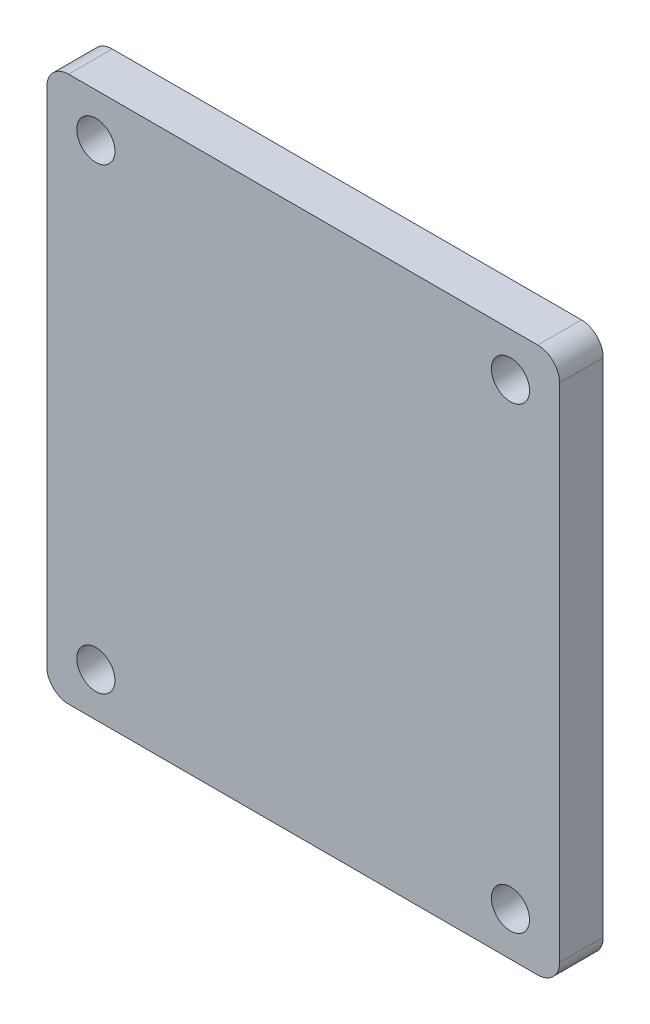
ISO-10303-21;
HEADER;
FILE_DESCRIPTION(('STEP AP214'),'2;1');
FILE_NAME('part.step','',(''),(''),'','','');
FILE_SCHEMA(('AUTOMOTIVE_DESIGN { 1 0 10303 214 1 1 1 1 }'));
ENDSEC;
DATA;
#1=APPLICATION_CONTEXT('core data for automotive mechanical design processes');
#2=APPLICATION_PROTOCOL_DEFINITION('international standard','automotive_design',2000,#1);
#3=PRODUCT_CONTEXT('',#1,'mechanical');
#4=PRODUCT('Part','Part','',(#3));
#5=PRODUCT_RELATED_PRODUCT_CATEGORY('part','',(#4));
#6=PRODUCT_DEFINITION_FORMATION('','',#4);
#7=PRODUCT_DEFINITION_CONTEXT('part definition',#1,'design');
#8=PRODUCT_DEFINITION('design','',#6,#7);
#9=PRODUCT_DEFINITION_SHAPE('','',#8);
#10=(LENGTH_UNIT() NAMED_UNIT(*) SI_UNIT(.MILLI.,.METRE.));
#11=(NAMED_UNIT(*) PLANE_ANGLE_UNIT() SI_UNIT($,.RADIAN.));
#12=(NAMED_UNIT(*) SI_UNIT($,.STERADIAN.) SOLID_ANGLE_UNIT());
#13=UNCERTAINTY_MEASURE_WITH_UNIT(LENGTH_MEASURE(1.E-05),#10,'distance_accuracy_value','');
#14=(GEOMETRIC_REPRESENTATION_CONTEXT(3) GLOBAL_UNCERTAINTY_ASSIGNED_CONTEXT((#13)) GLOBAL_UNIT_ASSIGNED_CONTEXT((#10,
#11,#12)) REPRESENTATION_CONTEXT('',''));
#15=CARTESIAN_POINT('',(0.,0.,0.));
#16=DIRECTION('',(0.,0.,1.));
#17=DIRECTION('',(1.,0.,0.));
#18=AXIS2_PLACEMENT_3D('',#15,#16,#17);
#19=CARTESIAN_POINT('',(0.,0.,4.));
#20=DIRECTION('',(0.,0.,-1.));
#21=DIRECTION('',(-1.,0.,0.));
#22=AXIS2_PLACEMENT_3D('',#19,#20,#21);
#23=PLANE('',#22);
#24=CARTESIAN_POINT('',(-19.,21.,4.));
#25=DIRECTION('',(0.,0.,1.));
#26=DIRECTION('',(1.,0.,0.));
#27=AXIS2_PLACEMENT_3D('',#24,#25,#26);
#28=CIRCLE('',#27,1.74999999999999);
#29=CARTESIAN_POINT('',(-17.25,21.,4.));
#30=VERTEX_POINT('',#29);
#31=EDGE_CURVE('E206',#30,#30,#28,.T.);
#32=ORIENTED_EDGE('',*,*,#31,.F.);
#33=EDGE_LOOP('',(#32));
#34=FACE_BOUND('',#33,.T.);
#35=CARTESIAN_POINT('',(19.,21.,4.));
#36=DIRECTION('',(0.,0.,1.));
#37=DIRECTION('',(1.,0.,0.));
#38=AXIS2_PLACEMENT_3D('',#35,#36,#37);
#39=CIRCLE('',#38,1.74999999999999);
#40=CARTESIAN_POINT('',(20.75,21.,4.));
#41=VERTEX_POINT('',#40);
#42=EDGE_CURVE('E200',#41,#41,#39,.T.);
#43=ORIENTED_EDGE('',*,*,#42,.F.);
#44=EDGE_LOOP('',(#43));
#45=FACE_BOUND('',#44,.T.);
#46=CARTESIAN_POINT('',(-19.,-21.,4.));
#47=DIRECTION('',(0.,0.,1.));
#48=DIRECTION('',(1.,0.,0.));
#49=AXIS2_PLACEMENT_3D('',#46,#47,#48);
#50=CIRCLE('',#49,1.74999999999999);
#51=CARTESIAN_POINT('',(-17.25,-21.,4.));
#52=VERTEX_POINT('',#51);
#53=EDGE_CURVE('E192',#52,#52,#50,.T.);
#54=ORIENTED_EDGE('',*,*,#53,.F.);
#55=EDGE_LOOP('',(#54));
#56=FACE_BOUND('',#55,.T.);
#57=DIRECTION('',(-1.,0.,0.));
#58=VECTOR('',#57,1.);
#59=CARTESIAN_POINT('',(-23.5,25.,4.));
#60=LINE('',#59,#58);
#61=CARTESIAN_POINT('',(21.5,25.,4.));
#62=VERTEX_POINT('',#61);
#63=CARTESIAN_POINT('',(-21.5,25.,4.));
#64=VERTEX_POINT('',#63);
#65=EDGE_CURVE('E174',#62,#64,#60,.T.);
#66=ORIENTED_EDGE('',*,*,#65,.T.);
#67=CARTESIAN_POINT('',(-21.5,23.,4.));
#68=DIRECTION('',(0.,0.,-1.));
#69=DIRECTION('',(-1.,0.,0.));
#70=AXIS2_PLACEMENT_3D('',#67,#68,#69);
#71=CIRCLE('',#70,2.);
#72=CARTESIAN_POINT('',(-23.5,23.,4.));
#73=VERTEX_POINT('',#72);
#74=EDGE_CURVE('E152',#64,#73,#71,.F.);
#75=ORIENTED_EDGE('',*,*,#74,.T.);
#76=DIRECTION('',(0.,-1.,0.));
#77=VECTOR('',#76,1.);
#78=CARTESIAN_POINT('',(-23.5,-25.,4.));
#79=LINE('',#78,#77);
#80=CARTESIAN_POINT('',(-23.5,-23.,4.));
#81=VERTEX_POINT('',#80);
#82=EDGE_CURVE('E123',#73,#81,#79,.T.);
#83=ORIENTED_EDGE('',*,*,#82,.T.);
#84=CARTESIAN_POINT('',(-21.5,-23.,4.));
#85=DIRECTION('',(0.,0.,-1.));
#86=DIRECTION('',(-1.,0.,0.));
#87=AXIS2_PLACEMENT_3D('',#84,#85,#86);
#88=CIRCLE('',#87,2.);
#89=CARTESIAN_POINT('',(-21.5,-25.,4.));
#90=VERTEX_POINT('',#89);
#91=EDGE_CURVE('E59',#81,#90,#88,.F.);
#92=ORIENTED_EDGE('',*,*,#91,.T.);
#93=DIRECTION('',(1.,0.,0.));
#94=VECTOR('',#93,1.);
#95=CARTESIAN_POINT('',(-23.5,-25.,4.));
#96=LINE('',#95,#94);
#97=CARTESIAN_POINT('',(21.5,-25.,4.));
#98=VERTEX_POINT('',#97);
#99=EDGE_CURVE('E138',#90,#98,#96,.T.);
#100=ORIENTED_EDGE('',*,*,#99,.T.);
#101=CARTESIAN_POINT('',(21.5,-23.,4.));
#102=DIRECTION('',(0.,0.,-1.));
#103=DIRECTION('',(-1.,0.,0.));
#104=AXIS2_PLACEMENT_3D('',#101,#102,#103);
#105=CIRCLE('',#104,2.);
#106=CARTESIAN_POINT('',(23.5,-23.,4.));
#107=VERTEX_POINT('',#106);
#108=EDGE_CURVE('E148',#98,#107,#105,.F.);
#109=ORIENTED_EDGE('',*,*,#108,.T.);
#110=DIRECTION('',(0.,1.,0.));
#111=VECTOR('',#110,1.);
#112=CARTESIAN_POINT('',(23.5,-25.,4.));
#113=LINE('',#112,#111);
#114=CARTESIAN_POINT('',(23.5,23.,4.));
#115=VERTEX_POINT('',#114);
#116=EDGE_CURVE('E132',#107,#115,#113,.T.);
#117=ORIENTED_EDGE('',*,*,#116,.T.);
#118=CARTESIAN_POINT('',(21.5,23.,4.));
#119=DIRECTION('',(0.,0.,-1.));
#120=DIRECTION('',(-1.,0.,0.));
#121=AXIS2_PLACEMENT_3D('',#118,#119,#120);
#122=CIRCLE('',#121,2.);
#123=EDGE_CURVE('E150',#115,#62,#122,.F.);
#124=ORIENTED_EDGE('',*,*,#123,.T.);
#125=EDGE_LOOP('',(#66,#75,#83,#92,#100,#109,#117,#124));
#126=FACE_BOUND('',#125,.T.);
#127=CARTESIAN_POINT('',(19.,-21.,4.));
#128=DIRECTION('',(0.,0.,1.));
#129=DIRECTION('',(1.,0.,0.));
#130=AXIS2_PLACEMENT_3D('',#127,#128,#129);
#131=CIRCLE('',#130,1.74999999999999);
#132=CARTESIAN_POINT('',(20.75,-21.,4.));
#133=VERTEX_POINT('',#132);
#134=EDGE_CURVE('E184',#133,#133,#131,.T.);
#135=ORIENTED_EDGE('',*,*,#134,.F.);
#136=EDGE_LOOP('',(#135));
#137=FACE_BOUND('',#136,.T.);
#138=ADVANCED_FACE('F39',(#34,#45,#56,#126,#137),#23,.F.);
#139=CARTESIAN_POINT('',(23.5,-25.,4.));
#140=DIRECTION('',(-1.,0.,0.));
#141=DIRECTION('',(0.,0.,1.));
#142=AXIS2_PLACEMENT_3D('',#139,#140,#141);
#143=PLANE('',#142);
#144=DIRECTION('',(0.,1.,0.));
#145=VECTOR('',#144,1.);
#146=CARTESIAN_POINT('',(23.5,-25.,0.));
#147=LINE('',#146,#145);
#148=CARTESIAN_POINT('',(23.5,-23.,0.));
#149=VERTEX_POINT('',#148);
#150=CARTESIAN_POINT('',(23.5,23.,0.));
#151=VERTEX_POINT('',#150);
#152=EDGE_CURVE('E134',#149,#151,#147,.T.);
#153=ORIENTED_EDGE('',*,*,#152,.T.);
#154=DIRECTION('',(0.,0.,-1.));
#155=VECTOR('',#154,1.);
#156=CARTESIAN_POINT('',(23.5,23.,4.));
#157=LINE('',#156,#155);
#158=EDGE_CURVE('E157',#151,#115,#157,.F.);
#159=ORIENTED_EDGE('',*,*,#158,.T.);
#160=ORIENTED_EDGE('',*,*,#116,.F.);
#161=DIRECTION('',(0.,0.,-1.));
#162=VECTOR('',#161,1.);
#163=CARTESIAN_POINT('',(23.5,-23.,4.));
#164=LINE('',#163,#162);
#165=EDGE_CURVE('E154',#107,#149,#164,.T.);
#166=ORIENTED_EDGE('',*,*,#165,.T.);
#167=EDGE_LOOP('',(#153,#159,#160,#166));
#168=FACE_BOUND('',#167,.T.);
#169=ADVANCED_FACE('F170',(#168),#143,.F.);
#170=CARTESIAN_POINT('',(-23.5,25.,4.));
#171=DIRECTION('',(0.,-1.,0.));
#172=DIRECTION('',(0.,0.,-1.));
#173=AXIS2_PLACEMENT_3D('',#170,#171,#172);
#174=PLANE('',#173);
#175=DIRECTION('',(-1.,0.,0.));
#176=VECTOR('',#175,1.);
#177=CARTESIAN_POINT('',(-23.5,25.,0.));
#178=LINE('',#177,#176);
#179=CARTESIAN_POINT('',(21.5,25.,0.));
#180=VERTEX_POINT('',#179);
#181=CARTESIAN_POINT('',(-21.5,25.,0.));
#182=VERTEX_POINT('',#181);
#183=EDGE_CURVE('E130',#180,#182,#178,.T.);
#184=ORIENTED_EDGE('',*,*,#183,.T.);
#185=DIRECTION('',(0.,0.,-1.));
#186=VECTOR('',#185,1.);
#187=CARTESIAN_POINT('',(-21.5,25.,4.));
#188=LINE('',#187,#186);
#189=EDGE_CURVE('E109',#182,#64,#188,.F.);
#190=ORIENTED_EDGE('',*,*,#189,.T.);
#191=ORIENTED_EDGE('',*,*,#65,.F.);
#192=DIRECTION('',(0.,0.,-1.));
#193=VECTOR('',#192,1.);
#194=CARTESIAN_POINT('',(21.5,25.,4.));
#195=LINE('',#194,#193);
#196=EDGE_CURVE('E114',#62,#180,#195,.T.);
#197=ORIENTED_EDGE('',*,*,#196,.T.);
#198=EDGE_LOOP('',(#184,#190,#191,#197));
#199=FACE_BOUND('',#198,.T.);
#200=ADVANCED_FACE('F223',(#199),#174,.F.);
#201=CARTESIAN_POINT('',(-23.5,-25.,4.));
#202=DIRECTION('',(1.,0.,0.));
#203=DIRECTION('',(0.,0.,-1.));
#204=AXIS2_PLACEMENT_3D('',#201,#202,#203);
#205=PLANE('',#204);
#206=ORIENTED_EDGE('',*,*,#82,.F.);
#207=DIRECTION('',(0.,0.,-1.));
#208=VECTOR('',#207,1.);
#209=CARTESIAN_POINT('',(-23.5,23.,4.));
#210=LINE('',#209,#208);
#211=CARTESIAN_POINT('',(-23.5,23.,0.));
#212=VERTEX_POINT('',#211);
#213=EDGE_CURVE('E108',#73,#212,#210,.T.);
#214=ORIENTED_EDGE('',*,*,#213,.T.);
#215=DIRECTION('',(0.,-1.,0.));
#216=VECTOR('',#215,1.);
#217=CARTESIAN_POINT('',(-23.5,-25.,0.));
#218=LINE('',#217,#216);
#219=CARTESIAN_POINT('',(-23.5,-23.,0.));
#220=VERTEX_POINT('',#219);
#221=EDGE_CURVE('E121',#212,#220,#218,.T.);
#222=ORIENTED_EDGE('',*,*,#221,.T.);
#223=DIRECTION('',(0.,0.,-1.));
#224=VECTOR('',#223,1.);
#225=CARTESIAN_POINT('',(-23.5,-23.,4.));
#226=LINE('',#225,#224);
#227=EDGE_CURVE('E125',#220,#81,#226,.F.);
#228=ORIENTED_EDGE('',*,*,#227,.T.);
#229=EDGE_LOOP('',(#206,#214,#222,#228));
#230=FACE_BOUND('',#229,.T.);
#231=ADVANCED_FACE('F120',(#230),#205,.F.);
#232=CARTESIAN_POINT('',(-23.5,-25.,4.));
#233=DIRECTION('',(0.,1.,0.));
#234=DIRECTION('',(0.,0.,1.));
#235=AXIS2_PLACEMENT_3D('',#232,#233,#234);
#236=PLANE('',#235);
#237=DIRECTION('',(1.,0.,0.));
#238=VECTOR('',#237,1.);
#239=CARTESIAN_POINT('',(-23.5,-25.,0.));
#240=LINE('',#239,#238);
#241=CARTESIAN_POINT('',(-21.5,-25.,0.));
#242=VERTEX_POINT('',#241);
#243=CARTESIAN_POINT('',(21.5,-25.,0.));
#244=VERTEX_POINT('',#243);
#245=EDGE_CURVE('E129',#242,#244,#240,.T.);
#246=ORIENTED_EDGE('',*,*,#245,.T.);
#247=DIRECTION('',(0.,0.,-1.));
#248=VECTOR('',#247,1.);
#249=CARTESIAN_POINT('',(21.5,-25.,4.));
#250=LINE('',#249,#248);
#251=EDGE_CURVE('E11',#244,#98,#250,.F.);
#252=ORIENTED_EDGE('',*,*,#251,.T.);
#253=ORIENTED_EDGE('',*,*,#99,.F.);
#254=DIRECTION('',(0.,0.,-1.));
#255=VECTOR('',#254,1.);
#256=CARTESIAN_POINT('',(-21.5,-25.,4.));
#257=LINE('',#256,#255);
#258=EDGE_CURVE('E47',#90,#242,#257,.T.);
#259=ORIENTED_EDGE('',*,*,#258,.T.);
#260=EDGE_LOOP('',(#246,#252,#253,#259));
#261=FACE_BOUND('',#260,.T.);
#262=ADVANCED_FACE('F160',(#261),#236,.F.);
#263=CARTESIAN_POINT('',(0.,0.,0.));
#264=DIRECTION('',(0.,0.,-1.));
#265=DIRECTION('',(-1.,0.,0.));
#266=AXIS2_PLACEMENT_3D('',#263,#264,#265);
#267=PLANE('',#266);
#268=CARTESIAN_POINT('',(-19.,21.,0.));
#269=DIRECTION('',(0.,0.,-1.));
#270=DIRECTION('',(-1.,0.,0.));
#271=AXIS2_PLACEMENT_3D('',#268,#269,#270);
#272=CIRCLE('',#271,1.75);
#273=CARTESIAN_POINT('',(-20.75,21.,0.));
#274=VERTEX_POINT('',#273);
#275=EDGE_CURVE('E203',#274,#274,#272,.T.);
#276=ORIENTED_EDGE('',*,*,#275,.F.);
#277=EDGE_LOOP('',(#276));
#278=FACE_BOUND('',#277,.T.);
#279=CARTESIAN_POINT('',(19.,21.,0.));
#280=DIRECTION('',(0.,0.,-1.));
#281=DIRECTION('',(-1.,0.,0.));
#282=AXIS2_PLACEMENT_3D('',#279,#280,#281);
#283=CIRCLE('',#282,1.75);
#284=CARTESIAN_POINT('',(17.25,21.,0.));
#285=VERTEX_POINT('',#284);
#286=EDGE_CURVE('E197',#285,#285,#283,.T.);
#287=ORIENTED_EDGE('',*,*,#286,.F.);
#288=EDGE_LOOP('',(#287));
#289=FACE_BOUND('',#288,.T.);
#290=CARTESIAN_POINT('',(-19.,-21.,0.));
#291=DIRECTION('',(0.,0.,-1.));
#292=DIRECTION('',(-1.,0.,0.));
#293=AXIS2_PLACEMENT_3D('',#290,#291,#292);
#294=CIRCLE('',#293,1.75);
#295=CARTESIAN_POINT('',(-20.75,-21.,0.));
#296=VERTEX_POINT('',#295);
#297=EDGE_CURVE('E188',#296,#296,#294,.T.);
#298=ORIENTED_EDGE('',*,*,#297,.F.);
#299=EDGE_LOOP('',(#298));
#300=FACE_BOUND('',#299,.T.);
#301=CARTESIAN_POINT('',(19.,-21.,0.));
#302=DIRECTION('',(0.,0.,-1.));
#303=DIRECTION('',(-1.,0.,0.));
#304=AXIS2_PLACEMENT_3D('',#301,#302,#303);
#305=CIRCLE('',#304,1.75);
#306=CARTESIAN_POINT('',(17.25,-21.,0.));
#307=VERTEX_POINT('',#306);
#308=EDGE_CURVE('E179',#307,#307,#305,.T.);
#309=ORIENTED_EDGE('',*,*,#308,.F.);
#310=EDGE_LOOP('',(#309));
#311=FACE_BOUND('',#310,.T.);
#312=ORIENTED_EDGE('',*,*,#221,.F.);
#313=CARTESIAN_POINT('',(-21.5,23.,0.));
#314=DIRECTION('',(0.,0.,-1.));
#315=DIRECTION('',(-1.,0.,0.));
#316=AXIS2_PLACEMENT_3D('',#313,#314,#315);
#317=CIRCLE('',#316,2.);
#318=EDGE_CURVE('E104',#212,#182,#317,.T.);
#319=ORIENTED_EDGE('',*,*,#318,.T.);
#320=ORIENTED_EDGE('',*,*,#183,.F.);
#321=CARTESIAN_POINT('',(21.5,23.,0.));
#322=DIRECTION('',(0.,0.,-1.));
#323=DIRECTION('',(-1.,0.,0.));
#324=AXIS2_PLACEMENT_3D('',#321,#322,#323);
#325=CIRCLE('',#324,2.);
#326=EDGE_CURVE('E115',#180,#151,#325,.T.);
#327=ORIENTED_EDGE('',*,*,#326,.T.);
#328=ORIENTED_EDGE('',*,*,#152,.F.);
#329=CARTESIAN_POINT('',(21.5,-23.,0.));
#330=DIRECTION('',(0.,0.,-1.));
#331=DIRECTION('',(-1.,0.,0.));
#332=AXIS2_PLACEMENT_3D('',#329,#330,#331);
#333=CIRCLE('',#332,2.);
#334=EDGE_CURVE('E141',#149,#244,#333,.T.);
#335=ORIENTED_EDGE('',*,*,#334,.T.);
#336=ORIENTED_EDGE('',*,*,#245,.F.);
#337=CARTESIAN_POINT('',(-21.5,-23.,0.));
#338=DIRECTION('',(0.,0.,-1.));
#339=DIRECTION('',(-1.,0.,0.));
#340=AXIS2_PLACEMENT_3D('',#337,#338,#339);
#341=CIRCLE('',#340,2.);
#342=EDGE_CURVE('E124',#242,#220,#341,.T.);
#343=ORIENTED_EDGE('',*,*,#342,.T.);
#344=EDGE_LOOP('',(#312,#319,#320,#327,#328,#335,#336,#343));
#345=FACE_BOUND('',#344,.T.);
#346=ADVANCED_FACE('F127',(#278,#289,#300,#311,#345),#267,.T.);
#347=CARTESIAN_POINT('',(19.,-21.,4.));
#348=DIRECTION('',(0.,0.,1.));
#349=DIRECTION('',(1.,0.,0.));
#350=AXIS2_PLACEMENT_3D('',#347,#348,#349);
#351=CYLINDRICAL_SURFACE('',#350,1.75);
#352=ORIENTED_EDGE('',*,*,#134,.T.);
#353=EDGE_LOOP('',(#352));
#354=FACE_BOUND('',#353,.T.);
#355=ORIENTED_EDGE('',*,*,#308,.T.);
#356=EDGE_LOOP('',(#355));
#357=FACE_BOUND('',#356,.T.);
#358=ADVANCED_FACE('F243',(#354,#357),#351,.F.);
#359=CARTESIAN_POINT('',(-19.,-21.,4.));
#360=DIRECTION('',(0.,0.,1.));
#361=DIRECTION('',(1.,0.,0.));
#362=AXIS2_PLACEMENT_3D('',#359,#360,#361);
#363=CYLINDRICAL_SURFACE('',#362,1.75);
#364=ORIENTED_EDGE('',*,*,#53,.T.);
#365=EDGE_LOOP('',(#364));
#366=FACE_BOUND('',#365,.T.);
#367=ORIENTED_EDGE('',*,*,#297,.T.);
#368=EDGE_LOOP('',(#367));
#369=FACE_BOUND('',#368,.T.);
#370=ADVANCED_FACE('F248',(#366,#369),#363,.F.);
#371=CARTESIAN_POINT('',(19.,21.,4.));
#372=DIRECTION('',(0.,0.,1.));
#373=DIRECTION('',(1.,0.,0.));
#374=AXIS2_PLACEMENT_3D('',#371,#372,#373);
#375=CYLINDRICAL_SURFACE('',#374,1.75);
#376=ORIENTED_EDGE('',*,*,#42,.T.);
#377=EDGE_LOOP('',(#376));
#378=FACE_BOUND('',#377,.T.);
#379=ORIENTED_EDGE('',*,*,#286,.T.);
#380=EDGE_LOOP('',(#379));
#381=FACE_BOUND('',#380,.T.);
#382=ADVANCED_FACE('F251',(#378,#381),#375,.F.);
#383=CARTESIAN_POINT('',(-19.,21.,4.));
#384=DIRECTION('',(0.,0.,1.));
#385=DIRECTION('',(1.,0.,0.));
#386=AXIS2_PLACEMENT_3D('',#383,#384,#385);
#387=CYLINDRICAL_SURFACE('',#386,1.75);
#388=ORIENTED_EDGE('',*,*,#31,.T.);
#389=EDGE_LOOP('',(#388));
#390=FACE_BOUND('',#389,.T.);
#391=ORIENTED_EDGE('',*,*,#275,.T.);
#392=EDGE_LOOP('',(#391));
#393=FACE_BOUND('',#392,.T.);
#394=ADVANCED_FACE('F210',(#390,#393),#387,.F.);
#395=CARTESIAN_POINT('',(-21.5,23.,4.));
#396=DIRECTION('',(0.,0.,-1.));
#397=DIRECTION('',(-1.,0.,0.));
#398=AXIS2_PLACEMENT_3D('',#395,#396,#397);
#399=CYLINDRICAL_SURFACE('',#398,2.);
#400=ORIENTED_EDGE('',*,*,#74,.F.);
#401=ORIENTED_EDGE('',*,*,#189,.F.);
#402=ORIENTED_EDGE('',*,*,#318,.F.);
#403=ORIENTED_EDGE('',*,*,#213,.F.);
#404=EDGE_LOOP('',(#400,#401,#402,#403));
#405=FACE_BOUND('',#404,.T.);
#406=ADVANCED_FACE('F107',(#405),#399,.T.);
#407=CARTESIAN_POINT('',(21.5,23.,4.));
#408=DIRECTION('',(0.,0.,-1.));
#409=DIRECTION('',(-1.,0.,0.));
#410=AXIS2_PLACEMENT_3D('',#407,#408,#409);
#411=CYLINDRICAL_SURFACE('',#410,2.);
#412=ORIENTED_EDGE('',*,*,#123,.F.);
#413=ORIENTED_EDGE('',*,*,#158,.F.);
#414=ORIENTED_EDGE('',*,*,#326,.F.);
#415=ORIENTED_EDGE('',*,*,#196,.F.);
#416=EDGE_LOOP('',(#412,#413,#414,#415));
#417=FACE_BOUND('',#416,.T.);
#418=ADVANCED_FACE('F225',(#417),#411,.T.);
#419=CARTESIAN_POINT('',(21.5,-23.,4.));
#420=DIRECTION('',(0.,0.,-1.));
#421=DIRECTION('',(-1.,0.,0.));
#422=AXIS2_PLACEMENT_3D('',#419,#420,#421);
#423=CYLINDRICAL_SURFACE('',#422,2.);
#424=ORIENTED_EDGE('',*,*,#108,.F.);
#425=ORIENTED_EDGE('',*,*,#251,.F.);
#426=ORIENTED_EDGE('',*,*,#334,.F.);
#427=ORIENTED_EDGE('',*,*,#165,.F.);
#428=EDGE_LOOP('',(#424,#425,#426,#427));
#429=FACE_BOUND('',#428,.T.);
#430=ADVANCED_FACE('F167',(#429),#423,.T.);
#431=CARTESIAN_POINT('',(-21.5,-23.,4.));
#432=DIRECTION('',(0.,0.,-1.));
#433=DIRECTION('',(-1.,0.,0.));
#434=AXIS2_PLACEMENT_3D('',#431,#432,#433);
#435=CYLINDRICAL_SURFACE('',#434,2.);
#436=ORIENTED_EDGE('',*,*,#91,.F.);
#437=ORIENTED_EDGE('',*,*,#227,.F.);
#438=ORIENTED_EDGE('',*,*,#342,.F.);
#439=ORIENTED_EDGE('',*,*,#258,.F.);
#440=EDGE_LOOP('',(#436,#437,#438,#439));
#441=FACE_BOUND('',#440,.T.);
#442=ADVANCED_FACE('F41',(#441),#435,.T.);
#443=CLOSED_SHELL('',(#138,#169,#200,#231,#262,#346,#358,#370,#382,#394,#406,#418,#430,#442));
#444=MANIFOLD_SOLID_BREP('B2',#443);
#445=ADVANCED_BREP_SHAPE_REPRESENTATION('',(#18,#444),#14);
#446=SHAPE_DEFINITION_REPRESENTATION(#9,#445);
ENDSEC;
END-ISO-10303-21;
